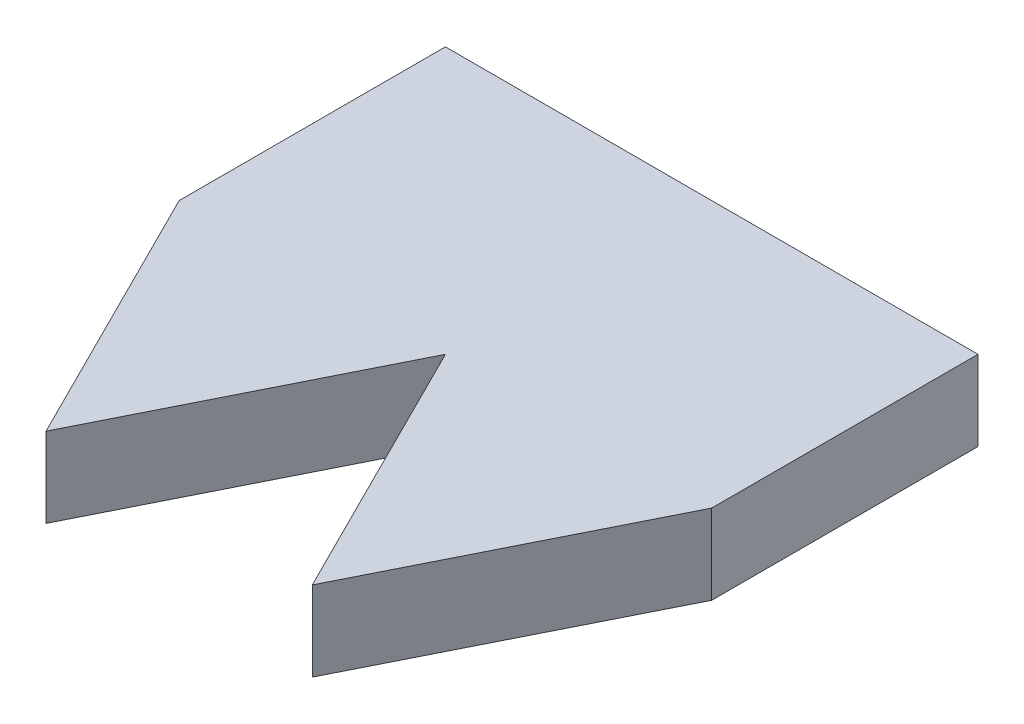
ISO-10303-21;
HEADER;
FILE_DESCRIPTION(('STEP AP214'),'2;1');
FILE_NAME('part.step','',(''),(''),'','','');
FILE_SCHEMA(('AUTOMOTIVE_DESIGN { 1 0 10303 214 1 1 1 1 }'));
ENDSEC;
DATA;
#1=APPLICATION_CONTEXT('core data for automotive mechanical design processes');
#2=APPLICATION_PROTOCOL_DEFINITION('international standard','automotive_design',2000,#1);
#3=PRODUCT_CONTEXT('',#1,'mechanical');
#4=PRODUCT('Part','Part','',(#3));
#5=PRODUCT_RELATED_PRODUCT_CATEGORY('part','',(#4));
#6=PRODUCT_DEFINITION_FORMATION('','',#4);
#7=PRODUCT_DEFINITION_CONTEXT('part definition',#1,'design');
#8=PRODUCT_DEFINITION('design','',#6,#7);
#9=PRODUCT_DEFINITION_SHAPE('','',#8);
#10=(LENGTH_UNIT() NAMED_UNIT(*) SI_UNIT(.MILLI.,.METRE.));
#11=(NAMED_UNIT(*) PLANE_ANGLE_UNIT() SI_UNIT($,.RADIAN.));
#12=(NAMED_UNIT(*) SI_UNIT($,.STERADIAN.) SOLID_ANGLE_UNIT());
#13=UNCERTAINTY_MEASURE_WITH_UNIT(LENGTH_MEASURE(1.E-05),#10,'distance_accuracy_value','');
#14=(GEOMETRIC_REPRESENTATION_CONTEXT(3) GLOBAL_UNCERTAINTY_ASSIGNED_CONTEXT((#13)) GLOBAL_UNIT_ASSIGNED_CONTEXT((#10,
#11,#12)) REPRESENTATION_CONTEXT('',''));
#15=CARTESIAN_POINT('',(0.,0.,0.));
#16=DIRECTION('',(0.,0.,1.));
#17=DIRECTION('',(1.,0.,0.));
#18=AXIS2_PLACEMENT_3D('',#15,#16,#17);
#19=CARTESIAN_POINT('',(0.,3.,0.));
#20=DIRECTION('',(0.,-1.,0.));
#21=DIRECTION('',(0.,0.,-1.));
#22=AXIS2_PLACEMENT_3D('',#19,#20,#21);
#23=PLANE('',#22);
#24=DIRECTION('',(-0.447213595499958,0.,-0.894427190999916));
#25=VECTOR('',#24,1.);
#26=CARTESIAN_POINT('',(0.,3.,0.));
#27=LINE('',#26,#25);
#28=CARTESIAN_POINT('',(5.,3.,10.));
#29=VERTEX_POINT('',#28);
#30=CARTESIAN_POINT('',(0.,3.,0.));
#31=VERTEX_POINT('',#30);
#32=EDGE_CURVE('E159',#29,#31,#27,.T.);
#33=ORIENTED_EDGE('',*,*,#32,.F.);
#34=DIRECTION('',(-0.447213595499958,0.,0.894427190999916));
#35=VECTOR('',#34,1.);
#36=CARTESIAN_POINT('',(8.,3.,4.));
#37=LINE('',#36,#35);
#38=CARTESIAN_POINT('',(10.,3.000006,0.));
#39=VERTEX_POINT('',#38);
#40=EDGE_CURVE('E141',#39,#29,#37,.T.);
#41=ORIENTED_EDGE('',*,*,#40,.F.);
#42=DIRECTION('',(0.,0.,-1.));
#43=VECTOR('',#42,1.);
#44=CARTESIAN_POINT('',(10.,3.,10.));
#45=LINE('',#44,#43);
#46=CARTESIAN_POINT('',(10.,3.,-10.));
#47=VERTEX_POINT('',#46);
#48=EDGE_CURVE('E128',#39,#47,#45,.T.);
#49=ORIENTED_EDGE('',*,*,#48,.T.);
#50=DIRECTION('',(-1.,0.,0.));
#51=VECTOR('',#50,1.);
#52=CARTESIAN_POINT('',(-10.,3.,-10.));
#53=LINE('',#52,#51);
#54=CARTESIAN_POINT('',(-10.,3.,-10.));
#55=VERTEX_POINT('',#54);
#56=EDGE_CURVE('E97',#47,#55,#53,.T.);
#57=ORIENTED_EDGE('',*,*,#56,.T.);
#58=DIRECTION('',(0.,0.,1.));
#59=VECTOR('',#58,1.);
#60=CARTESIAN_POINT('',(-10.,3.,10.));
#61=LINE('',#60,#59);
#62=CARTESIAN_POINT('',(-10.,3.,0.));
#63=VERTEX_POINT('',#62);
#64=EDGE_CURVE('E74',#55,#63,#61,.T.);
#65=ORIENTED_EDGE('',*,*,#64,.T.);
#66=DIRECTION('',(-0.447213595499958,0.,-0.894427190999916));
#67=VECTOR('',#66,1.);
#68=CARTESIAN_POINT('',(-8.,3.,4.));
#69=LINE('',#68,#67);
#70=CARTESIAN_POINT('',(-5.,3.,10.));
#71=VERTEX_POINT('',#70);
#72=EDGE_CURVE('E138',#71,#63,#69,.T.);
#73=ORIENTED_EDGE('',*,*,#72,.F.);
#74=DIRECTION('',(-0.447213595499958,0.,0.894427190999916));
#75=VECTOR('',#74,1.);
#76=CARTESIAN_POINT('',(0.,3.,0.));
#77=LINE('',#76,#75);
#78=EDGE_CURVE('E167',#31,#71,#77,.T.);
#79=ORIENTED_EDGE('',*,*,#78,.F.);
#80=EDGE_LOOP('',(#33,#41,#49,#57,#65,#73,#79));
#81=FACE_BOUND('',#80,.T.);
#82=ADVANCED_FACE('F70',(#81),#23,.F.);
#83=CARTESIAN_POINT('',(0.,0.,0.));
#84=DIRECTION('',(0.,-1.,0.));
#85=DIRECTION('',(0.,0.,-1.));
#86=AXIS2_PLACEMENT_3D('',#83,#84,#85);
#87=PLANE('',#86);
#88=DIRECTION('',(0.447213595499958,0.,-0.894427190999916));
#89=VECTOR('',#88,1.);
#90=CARTESIAN_POINT('',(8.,0.,4.));
#91=LINE('',#90,#89);
#92=CARTESIAN_POINT('',(5.,0.,10.));
#93=VERTEX_POINT('',#92);
#94=CARTESIAN_POINT('',(10.,0.,0.));
#95=VERTEX_POINT('',#94);
#96=EDGE_CURVE('E156',#93,#95,#91,.T.);
#97=ORIENTED_EDGE('',*,*,#96,.F.);
#98=DIRECTION('',(0.447213595499958,0.,0.894427190999916));
#99=VECTOR('',#98,1.);
#100=CARTESIAN_POINT('',(0.,0.,0.));
#101=LINE('',#100,#99);
#102=CARTESIAN_POINT('',(0.,0.,0.));
#103=VERTEX_POINT('',#102);
#104=EDGE_CURVE('E179',#103,#93,#101,.T.);
#105=ORIENTED_EDGE('',*,*,#104,.F.);
#106=DIRECTION('',(0.447213595499958,0.,-0.894427190999916));
#107=VECTOR('',#106,1.);
#108=CARTESIAN_POINT('',(0.,0.,0.));
#109=LINE('',#108,#107);
#110=CARTESIAN_POINT('',(-5.,0.,10.));
#111=VERTEX_POINT('',#110);
#112=EDGE_CURVE('E174',#111,#103,#109,.T.);
#113=ORIENTED_EDGE('',*,*,#112,.F.);
#114=DIRECTION('',(0.447213595499958,0.,0.894427190999916));
#115=VECTOR('',#114,1.);
#116=CARTESIAN_POINT('',(-8.,0.,4.));
#117=LINE('',#116,#115);
#118=CARTESIAN_POINT('',(-10.,0.,0.));
#119=VERTEX_POINT('',#118);
#120=EDGE_CURVE('E127',#119,#111,#117,.T.);
#121=ORIENTED_EDGE('',*,*,#120,.F.);
#122=DIRECTION('',(0.,0.,1.));
#123=VECTOR('',#122,1.);
#124=CARTESIAN_POINT('',(-10.,0.,10.));
#125=LINE('',#124,#123);
#126=CARTESIAN_POINT('',(-10.,0.,-10.));
#127=VERTEX_POINT('',#126);
#128=EDGE_CURVE('E117',#127,#119,#125,.T.);
#129=ORIENTED_EDGE('',*,*,#128,.F.);
#130=DIRECTION('',(-1.,0.,0.));
#131=VECTOR('',#130,1.);
#132=CARTESIAN_POINT('',(-10.,0.,-10.));
#133=LINE('',#132,#131);
#134=CARTESIAN_POINT('',(10.,0.,-10.));
#135=VERTEX_POINT('',#134);
#136=EDGE_CURVE('E109',#135,#127,#133,.T.);
#137=ORIENTED_EDGE('',*,*,#136,.F.);
#138=DIRECTION('',(0.,0.,-1.));
#139=VECTOR('',#138,1.);
#140=CARTESIAN_POINT('',(10.,0.,10.));
#141=LINE('',#140,#139);
#142=EDGE_CURVE('E118',#95,#135,#141,.T.);
#143=ORIENTED_EDGE('',*,*,#142,.F.);
#144=EDGE_LOOP('',(#97,#105,#113,#121,#129,#137,#143));
#145=FACE_BOUND('',#144,.T.);
#146=ADVANCED_FACE('F125',(#145),#87,.T.);
#147=CARTESIAN_POINT('',(10.,3.,10.));
#148=DIRECTION('',(-1.,0.,0.));
#149=DIRECTION('',(0.,0.,1.));
#150=AXIS2_PLACEMENT_3D('',#147,#148,#149);
#151=PLANE('',#150);
#152=DIRECTION('',(0.,1.,0.));
#153=VECTOR('',#152,1.);
#154=CARTESIAN_POINT('',(10.,0.,0.));
#155=LINE('',#154,#153);
#156=EDGE_CURVE('E153',#95,#39,#155,.T.);
#157=ORIENTED_EDGE('',*,*,#156,.F.);
#158=ORIENTED_EDGE('',*,*,#142,.T.);
#159=DIRECTION('',(0.,-1.,0.));
#160=VECTOR('',#159,1.);
#161=CARTESIAN_POINT('',(10.,3.,-10.));
#162=LINE('',#161,#160);
#163=EDGE_CURVE('E12',#47,#135,#162,.T.);
#164=ORIENTED_EDGE('',*,*,#163,.F.);
#165=ORIENTED_EDGE('',*,*,#48,.F.);
#166=EDGE_LOOP('',(#157,#158,#164,#165));
#167=FACE_BOUND('',#166,.T.);
#168=ADVANCED_FACE('F72',(#167),#151,.F.);
#169=CARTESIAN_POINT('',(-10.,3.,10.));
#170=DIRECTION('',(1.,0.,0.));
#171=DIRECTION('',(0.,0.,-1.));
#172=AXIS2_PLACEMENT_3D('',#169,#170,#171);
#173=PLANE('',#172);
#174=DIRECTION('',(0.,1.,0.));
#175=VECTOR('',#174,1.);
#176=CARTESIAN_POINT('',(-10.,0.,0.));
#177=LINE('',#176,#175);
#178=EDGE_CURVE('E88',#119,#63,#177,.T.);
#179=ORIENTED_EDGE('',*,*,#178,.T.);
#180=ORIENTED_EDGE('',*,*,#64,.F.);
#181=DIRECTION('',(0.,-1.,0.));
#182=VECTOR('',#181,1.);
#183=CARTESIAN_POINT('',(-10.,3.,-10.));
#184=LINE('',#183,#182);
#185=EDGE_CURVE('E80',#55,#127,#184,.T.);
#186=ORIENTED_EDGE('',*,*,#185,.T.);
#187=ORIENTED_EDGE('',*,*,#128,.T.);
#188=EDGE_LOOP('',(#179,#180,#186,#187));
#189=FACE_BOUND('',#188,.T.);
#190=ADVANCED_FACE('F122',(#189),#173,.F.);
#191=CARTESIAN_POINT('',(-10.,3.,-10.));
#192=DIRECTION('',(0.,0.,1.));
#193=DIRECTION('',(1.,0.,0.));
#194=AXIS2_PLACEMENT_3D('',#191,#192,#193);
#195=PLANE('',#194);
#196=ORIENTED_EDGE('',*,*,#136,.T.);
#197=ORIENTED_EDGE('',*,*,#185,.F.);
#198=ORIENTED_EDGE('',*,*,#56,.F.);
#199=ORIENTED_EDGE('',*,*,#163,.T.);
#200=EDGE_LOOP('',(#196,#197,#198,#199));
#201=FACE_BOUND('',#200,.T.);
#202=ADVANCED_FACE('F111',(#201),#195,.F.);
#203=CARTESIAN_POINT('',(8.,0.,4.));
#204=DIRECTION('',(0.894427190999916,0.,0.447213595499958));
#205=DIRECTION('',(0.447213595499958,0.,-0.894427190999916));
#206=AXIS2_PLACEMENT_3D('',#203,#204,#205);
#207=PLANE('',#206);
#208=ORIENTED_EDGE('',*,*,#40,.T.);
#209=DIRECTION('',(0.,1.,0.));
#210=VECTOR('',#209,1.);
#211=CARTESIAN_POINT('',(5.,0.,10.));
#212=LINE('',#211,#210);
#213=EDGE_CURVE('E170',#93,#29,#212,.T.);
#214=ORIENTED_EDGE('',*,*,#213,.F.);
#215=ORIENTED_EDGE('',*,*,#96,.T.);
#216=ORIENTED_EDGE('',*,*,#156,.T.);
#217=EDGE_LOOP('',(#208,#214,#215,#216));
#218=FACE_BOUND('',#217,.T.);
#219=ADVANCED_FACE('F194',(#218),#207,.T.);
#220=CARTESIAN_POINT('',(-8.,0.,4.));
#221=DIRECTION('',(-0.894427190999916,0.,0.447213595499958));
#222=DIRECTION('',(0.447213595499958,0.,0.894427190999916));
#223=AXIS2_PLACEMENT_3D('',#220,#221,#222);
#224=PLANE('',#223);
#225=ORIENTED_EDGE('',*,*,#72,.T.);
#226=ORIENTED_EDGE('',*,*,#178,.F.);
#227=ORIENTED_EDGE('',*,*,#120,.T.);
#228=DIRECTION('',(0.,1.,0.));
#229=VECTOR('',#228,1.);
#230=CARTESIAN_POINT('',(-5.,0.,10.));
#231=LINE('',#230,#229);
#232=EDGE_CURVE('E146',#111,#71,#231,.T.);
#233=ORIENTED_EDGE('',*,*,#232,.T.);
#234=EDGE_LOOP('',(#225,#226,#227,#233));
#235=FACE_BOUND('',#234,.T.);
#236=ADVANCED_FACE('F205',(#235),#224,.T.);
#237=CARTESIAN_POINT('',(0.,0.,0.));
#238=DIRECTION('',(-0.894427190999916,0.,0.447213595499958));
#239=DIRECTION('',(0.447213595499958,0.,0.894427190999916));
#240=AXIS2_PLACEMENT_3D('',#237,#238,#239);
#241=PLANE('',#240);
#242=ORIENTED_EDGE('',*,*,#32,.T.);
#243=DIRECTION('',(0.,1.,0.));
#244=VECTOR('',#243,1.);
#245=CARTESIAN_POINT('',(0.,0.,0.));
#246=LINE('',#245,#244);
#247=EDGE_CURVE('E171',#103,#31,#246,.T.);
#248=ORIENTED_EDGE('',*,*,#247,.F.);
#249=ORIENTED_EDGE('',*,*,#104,.T.);
#250=ORIENTED_EDGE('',*,*,#213,.T.);
#251=EDGE_LOOP('',(#242,#248,#249,#250));
#252=FACE_BOUND('',#251,.T.);
#253=ADVANCED_FACE('F186',(#252),#241,.T.);
#254=CARTESIAN_POINT('',(0.,0.,0.));
#255=DIRECTION('',(0.894427190999916,0.,0.447213595499958));
#256=DIRECTION('',(0.447213595499958,0.,-0.894427190999916));
#257=AXIS2_PLACEMENT_3D('',#254,#255,#256);
#258=PLANE('',#257);
#259=ORIENTED_EDGE('',*,*,#78,.T.);
#260=ORIENTED_EDGE('',*,*,#232,.F.);
#261=ORIENTED_EDGE('',*,*,#112,.T.);
#262=ORIENTED_EDGE('',*,*,#247,.T.);
#263=EDGE_LOOP('',(#259,#260,#261,#262));
#264=FACE_BOUND('',#263,.T.);
#265=ADVANCED_FACE('F204',(#264),#258,.T.);
#266=CLOSED_SHELL('',(#82,#146,#168,#190,#202,#219,#236,#253,#265));
#267=MANIFOLD_SOLID_BREP('B2',#266);
#268=ADVANCED_BREP_SHAPE_REPRESENTATION('',(#18,#267),#14);
#269=SHAPE_DEFINITION_REPRESENTATION(#9,#268);
ENDSEC;
END-ISO-10303-21;
